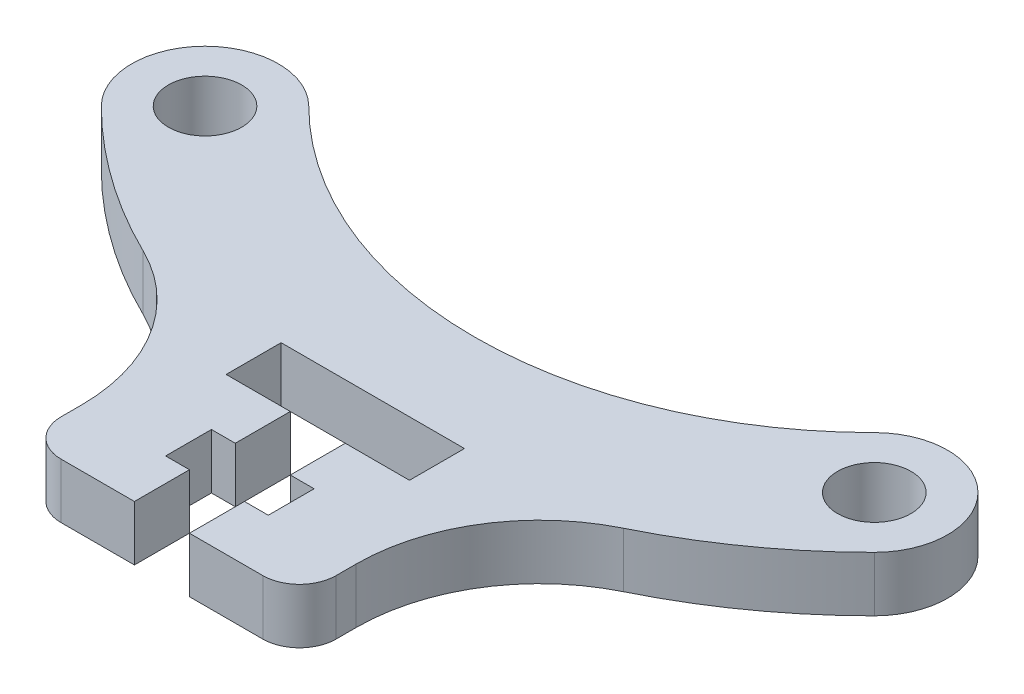
ISO-10303-21;
HEADER;
FILE_DESCRIPTION(('STEP AP214'),'2;1');
FILE_NAME('part.step','',(''),(''),'','','');
FILE_SCHEMA(('AUTOMOTIVE_DESIGN { 1 0 10303 214 1 1 1 1 }'));
ENDSEC;
DATA;
#1=APPLICATION_CONTEXT('core data for automotive mechanical design processes');
#2=APPLICATION_PROTOCOL_DEFINITION('international standard','automotive_design',2000,#1);
#3=PRODUCT_CONTEXT('',#1,'mechanical');
#4=PRODUCT('Part','Part','',(#3));
#5=PRODUCT_RELATED_PRODUCT_CATEGORY('part','',(#4));
#6=PRODUCT_DEFINITION_FORMATION('','',#4);
#7=PRODUCT_DEFINITION_CONTEXT('part definition',#1,'design');
#8=PRODUCT_DEFINITION('design','',#6,#7);
#9=PRODUCT_DEFINITION_SHAPE('','',#8);
#10=(LENGTH_UNIT() NAMED_UNIT(*) SI_UNIT(.MILLI.,.METRE.));
#11=(NAMED_UNIT(*) PLANE_ANGLE_UNIT() SI_UNIT($,.RADIAN.));
#12=(NAMED_UNIT(*) SI_UNIT($,.STERADIAN.) SOLID_ANGLE_UNIT());
#13=UNCERTAINTY_MEASURE_WITH_UNIT(LENGTH_MEASURE(1.E-05),#10,'distance_accuracy_value','');
#14=(GEOMETRIC_REPRESENTATION_CONTEXT(3) GLOBAL_UNCERTAINTY_ASSIGNED_CONTEXT((#13)) GLOBAL_UNIT_ASSIGNED_CONTEXT((#10,
#11,#12)) REPRESENTATION_CONTEXT('',''));
#15=CARTESIAN_POINT('',(0.,0.,0.));
#16=DIRECTION('',(0.,0.,1.));
#17=DIRECTION('',(1.,0.,0.));
#18=AXIS2_PLACEMENT_3D('',#15,#16,#17);
#19=CARTESIAN_POINT('',(-7.5,0.,20.6002501970721));
#20=DIRECTION('',(0.,0.,1.));
#21=DIRECTION('',(1.,0.,0.));
#22=AXIS2_PLACEMENT_3D('',#19,#20,#21);
#23=PLANE('',#22);
#24=DIRECTION('',(1.,0.,0.));
#25=VECTOR('',#24,1.);
#26=CARTESIAN_POINT('',(-7.5,3.,20.6002501970721));
#27=LINE('',#26,#25);
#28=CARTESIAN_POINT('',(-5.5,3.,20.6002501970721));
#29=VERTEX_POINT('',#28);
#30=CARTESIAN_POINT('',(-1.5,3.,20.6002501970721));
#31=VERTEX_POINT('',#30);
#32=EDGE_CURVE('E366',#29,#31,#27,.T.);
#33=ORIENTED_EDGE('',*,*,#32,.F.);
#34=DIRECTION('',(0.,1.,0.));
#35=VECTOR('',#34,1.);
#36=CARTESIAN_POINT('',(-5.5,0.,20.6002501970721));
#37=LINE('',#36,#35);
#38=CARTESIAN_POINT('',(-5.5,0.,20.6002501970721));
#39=VERTEX_POINT('',#38);
#40=EDGE_CURVE('E11',#29,#39,#37,.F.);
#41=ORIENTED_EDGE('',*,*,#40,.T.);
#42=DIRECTION('',(1.,0.,0.));
#43=VECTOR('',#42,1.);
#44=CARTESIAN_POINT('',(-7.5,0.,20.6002501970721));
#45=LINE('',#44,#43);
#46=CARTESIAN_POINT('',(-1.5,0.,20.6002501970721));
#47=VERTEX_POINT('',#46);
#48=EDGE_CURVE('E358',#39,#47,#45,.T.);
#49=ORIENTED_EDGE('',*,*,#48,.T.);
#50=DIRECTION('',(0.,1.,0.));
#51=VECTOR('',#50,1.);
#52=CARTESIAN_POINT('',(-1.5,0.,20.6002501970721));
#53=LINE('',#52,#51);
#54=EDGE_CURVE('E325',#47,#31,#53,.T.);
#55=ORIENTED_EDGE('',*,*,#54,.T.);
#56=EDGE_LOOP('',(#33,#41,#49,#55));
#57=FACE_BOUND('',#56,.T.);
#58=ADVANCED_FACE('F33',(#57),#23,.T.);
#59=CARTESIAN_POINT('',(0.,3.,-18.2508520349051));
#60=DIRECTION('',(0.,-1.,0.));
#61=DIRECTION('',(0.,0.,-1.));
#62=AXIS2_PLACEMENT_3D('',#59,#60,#61);
#63=CYLINDRICAL_SURFACE('',#62,29.81);
#64=CARTESIAN_POINT('',(0.,3.,-18.2508520349051));
#65=DIRECTION('',(0.,1.,0.));
#66=DIRECTION('',(0.,0.,1.));
#67=AXIS2_PLACEMENT_3D('',#64,#65,#66);
#68=CIRCLE('',#67,29.81);
#69=CARTESIAN_POINT('',(13.1041195679478,3.,8.52447523384977));
#70=VERTEX_POINT('',#69);
#71=CARTESIAN_POINT('',(21.0783611003487,3.,2.8284931476025));
#72=VERTEX_POINT('',#71);
#73=EDGE_CURVE('E378',#70,#72,#68,.T.);
#74=ORIENTED_EDGE('',*,*,#73,.F.);
#75=DIRECTION('',(0.,-1.,0.));
#76=VECTOR('',#75,1.);
#77=CARTESIAN_POINT('',(13.1041195679478,3.,8.52447523384977));
#78=LINE('',#77,#76);
#79=CARTESIAN_POINT('',(13.1041195679478,0.,8.52447523384977));
#80=VERTEX_POINT('',#79);
#81=EDGE_CURVE('E417',#70,#80,#78,.T.);
#82=ORIENTED_EDGE('',*,*,#81,.T.);
#83=CARTESIAN_POINT('',(0.,0.,-18.2508520349051));
#84=DIRECTION('',(0.,1.,0.));
#85=DIRECTION('',(0.,0.,1.));
#86=AXIS2_PLACEMENT_3D('',#83,#84,#85);
#87=CIRCLE('',#86,29.81);
#88=CARTESIAN_POINT('',(21.0783611003487,0.,2.8284931476025));
#89=VERTEX_POINT('',#88);
#90=EDGE_CURVE('E396',#80,#89,#87,.T.);
#91=ORIENTED_EDGE('',*,*,#90,.T.);
#92=DIRECTION('',(0.,-1.,0.));
#93=VECTOR('',#92,1.);
#94=CARTESIAN_POINT('',(21.0783611003487,3.,2.8284931476025));
#95=LINE('',#94,#93);
#96=EDGE_CURVE('E388',#72,#89,#95,.T.);
#97=ORIENTED_EDGE('',*,*,#96,.F.);
#98=EDGE_LOOP('',(#74,#82,#91,#97));
#99=FACE_BOUND('',#98,.T.);
#100=ADVANCED_FACE('F552',(#99),#63,.T.);
#101=CARTESIAN_POINT('',(18.25,3.,0.));
#102=DIRECTION('',(0.,-1.,0.));
#103=DIRECTION('',(0.,0.,-1.));
#104=AXIS2_PLACEMENT_3D('',#101,#102,#103);
#105=CYLINDRICAL_SURFACE('',#104,4.);
#106=CARTESIAN_POINT('',(18.25,0.,0.));
#107=DIRECTION('',(0.,1.,0.));
#108=DIRECTION('',(0.,0.,1.));
#109=AXIS2_PLACEMENT_3D('',#106,#107,#108);
#110=CIRCLE('',#109,4.);
#111=CARTESIAN_POINT('',(15.4216388996513,0.,-2.82849314760251));
#112=VERTEX_POINT('',#111);
#113=EDGE_CURVE('E362',#112,#89,#110,.F.);
#114=ORIENTED_EDGE('',*,*,#113,.F.);
#115=DIRECTION('',(0.,-1.,0.));
#116=VECTOR('',#115,1.);
#117=CARTESIAN_POINT('',(15.4216388996513,3.,-2.82849314760251));
#118=LINE('',#117,#116);
#119=CARTESIAN_POINT('',(15.4216388996513,3.,-2.82849314760251));
#120=VERTEX_POINT('',#119);
#121=EDGE_CURVE('E412',#120,#112,#118,.T.);
#122=ORIENTED_EDGE('',*,*,#121,.F.);
#123=CARTESIAN_POINT('',(18.25,3.,0.));
#124=DIRECTION('',(0.,1.,0.));
#125=DIRECTION('',(0.,0.,1.));
#126=AXIS2_PLACEMENT_3D('',#123,#124,#125);
#127=CIRCLE('',#126,4.);
#128=EDGE_CURVE('E369',#120,#72,#127,.F.);
#129=ORIENTED_EDGE('',*,*,#128,.T.);
#130=ORIENTED_EDGE('',*,*,#96,.T.);
#131=EDGE_LOOP('',(#114,#122,#129,#130));
#132=FACE_BOUND('',#131,.T.);
#133=ADVANCED_FACE('F474',(#132),#105,.T.);
#134=CARTESIAN_POINT('',(0.,3.,-18.2508520349051));
#135=DIRECTION('',(0.,-1.,0.));
#136=DIRECTION('',(0.,0.,-1.));
#137=AXIS2_PLACEMENT_3D('',#134,#135,#136);
#138=CYLINDRICAL_SURFACE('',#137,21.81);
#139=CARTESIAN_POINT('',(0.,0.,-18.2508520349051));
#140=DIRECTION('',(0.,1.,0.));
#141=DIRECTION('',(0.,0.,1.));
#142=AXIS2_PLACEMENT_3D('',#139,#140,#141);
#143=CIRCLE('',#142,21.81);
#144=CARTESIAN_POINT('',(-15.4216388996513,0.,-2.8284931476025));
#145=VERTEX_POINT('',#144);
#146=EDGE_CURVE('E391',#145,#112,#143,.T.);
#147=ORIENTED_EDGE('',*,*,#146,.F.);
#148=DIRECTION('',(0.,-1.,0.));
#149=VECTOR('',#148,1.);
#150=CARTESIAN_POINT('',(-15.4216388996513,3.,-2.8284931476025));
#151=LINE('',#150,#149);
#152=CARTESIAN_POINT('',(-15.4216388996513,3.,-2.8284931476025));
#153=VERTEX_POINT('',#152);
#154=EDGE_CURVE('E410',#153,#145,#151,.T.);
#155=ORIENTED_EDGE('',*,*,#154,.F.);
#156=CARTESIAN_POINT('',(0.,3.,-18.2508520349051));
#157=DIRECTION('',(0.,1.,0.));
#158=DIRECTION('',(0.,0.,1.));
#159=AXIS2_PLACEMENT_3D('',#156,#157,#158);
#160=CIRCLE('',#159,21.81);
#161=EDGE_CURVE('E372',#153,#120,#160,.T.);
#162=ORIENTED_EDGE('',*,*,#161,.T.);
#163=ORIENTED_EDGE('',*,*,#121,.T.);
#164=EDGE_LOOP('',(#147,#155,#162,#163));
#165=FACE_BOUND('',#164,.T.);
#166=ADVANCED_FACE('F468',(#165),#138,.F.);
#167=CARTESIAN_POINT('',(-18.25,3.,0.));
#168=DIRECTION('',(0.,-1.,0.));
#169=DIRECTION('',(0.,0.,-1.));
#170=AXIS2_PLACEMENT_3D('',#167,#168,#169);
#171=CYLINDRICAL_SURFACE('',#170,4.);
#172=CARTESIAN_POINT('',(-18.25,0.,0.));
#173=DIRECTION('',(0.,1.,0.));
#174=DIRECTION('',(0.,0.,1.));
#175=AXIS2_PLACEMENT_3D('',#172,#173,#174);
#176=CIRCLE('',#175,4.);
#177=CARTESIAN_POINT('',(-21.0783611003487,0.,2.82849314760249));
#178=VERTEX_POINT('',#177);
#179=EDGE_CURVE('E394',#145,#178,#176,.T.);
#180=ORIENTED_EDGE('',*,*,#179,.T.);
#181=DIRECTION('',(0.,-1.,0.));
#182=VECTOR('',#181,1.);
#183=CARTESIAN_POINT('',(-21.0783611003487,3.,2.82849314760249));
#184=LINE('',#183,#182);
#185=CARTESIAN_POINT('',(-21.0783611003487,3.,2.82849314760249));
#186=VERTEX_POINT('',#185);
#187=EDGE_CURVE('E407',#186,#178,#184,.T.);
#188=ORIENTED_EDGE('',*,*,#187,.F.);
#189=CARTESIAN_POINT('',(-18.25,3.,0.));
#190=DIRECTION('',(0.,1.,0.));
#191=DIRECTION('',(0.,0.,1.));
#192=AXIS2_PLACEMENT_3D('',#189,#190,#191);
#193=CIRCLE('',#192,4.);
#194=EDGE_CURVE('E376',#153,#186,#193,.T.);
#195=ORIENTED_EDGE('',*,*,#194,.F.);
#196=ORIENTED_EDGE('',*,*,#154,.T.);
#197=EDGE_LOOP('',(#180,#188,#195,#196));
#198=FACE_BOUND('',#197,.T.);
#199=ADVANCED_FACE('F782',(#198),#171,.T.);
#200=CARTESIAN_POINT('',(18.25,3.,0.));
#201=DIRECTION('',(0.,-1.,0.));
#202=DIRECTION('',(0.,0.,-1.));
#203=AXIS2_PLACEMENT_3D('',#200,#201,#202);
#204=CYLINDRICAL_SURFACE('',#203,2.);
#205=CARTESIAN_POINT('',(18.25,3.,0.));
#206=DIRECTION('',(0.,1.,0.));
#207=DIRECTION('',(0.,0.,1.));
#208=AXIS2_PLACEMENT_3D('',#205,#206,#207);
#209=CIRCLE('',#208,2.);
#210=CARTESIAN_POINT('',(18.25,3.,1.99999999999999));
#211=VERTEX_POINT('',#210);
#212=EDGE_CURVE('E382',#211,#211,#209,.T.);
#213=ORIENTED_EDGE('',*,*,#212,.T.);
#214=EDGE_LOOP('',(#213));
#215=FACE_BOUND('',#214,.T.);
#216=CARTESIAN_POINT('',(18.25,0.,0.));
#217=DIRECTION('',(0.,1.,0.));
#218=DIRECTION('',(0.,0.,1.));
#219=AXIS2_PLACEMENT_3D('',#216,#217,#218);
#220=CIRCLE('',#219,2.);
#221=CARTESIAN_POINT('',(18.25,0.,1.99999999999999));
#222=VERTEX_POINT('',#221);
#223=EDGE_CURVE('E400',#222,#222,#220,.T.);
#224=ORIENTED_EDGE('',*,*,#223,.F.);
#225=EDGE_LOOP('',(#224));
#226=FACE_BOUND('',#225,.T.);
#227=ADVANCED_FACE('F764',(#215,#226),#204,.F.);
#228=CARTESIAN_POINT('',(-13.1041195679478,0.,8.52447523384977));
#229=VERTEX_POINT('',#228);
#230=EDGE_CURVE('E397',#178,#229,#87,.T.);
#231=ORIENTED_EDGE('',*,*,#230,.T.);
#232=DIRECTION('',(0.,-1.,0.));
#233=VECTOR('',#232,1.);
#234=CARTESIAN_POINT('',(-13.1041195679478,3.,8.52447523384977));
#235=LINE('',#234,#233);
#236=CARTESIAN_POINT('',(-13.1041195679478,3.,8.52447523384977));
#237=VERTEX_POINT('',#236);
#238=EDGE_CURVE('E419',#229,#237,#235,.F.);
#239=ORIENTED_EDGE('',*,*,#238,.T.);
#240=EDGE_CURVE('E379',#186,#237,#68,.T.);
#241=ORIENTED_EDGE('',*,*,#240,.F.);
#242=ORIENTED_EDGE('',*,*,#187,.T.);
#243=EDGE_LOOP('',(#231,#239,#241,#242));
#244=FACE_BOUND('',#243,.T.);
#245=ADVANCED_FACE('F461',(#244),#63,.T.);
#246=CARTESIAN_POINT('',(-18.25,3.,0.));
#247=DIRECTION('',(0.,-1.,0.));
#248=DIRECTION('',(0.,0.,-1.));
#249=AXIS2_PLACEMENT_3D('',#246,#247,#248);
#250=CYLINDRICAL_SURFACE('',#249,2.);
#251=CARTESIAN_POINT('',(-18.25,3.,0.));
#252=DIRECTION('',(0.,1.,0.));
#253=DIRECTION('',(0.,0.,1.));
#254=AXIS2_PLACEMENT_3D('',#251,#252,#253);
#255=CIRCLE('',#254,2.);
#256=CARTESIAN_POINT('',(-18.25,3.,2.));
#257=VERTEX_POINT('',#256);
#258=EDGE_CURVE('E385',#257,#257,#255,.T.);
#259=ORIENTED_EDGE('',*,*,#258,.T.);
#260=EDGE_LOOP('',(#259));
#261=FACE_BOUND('',#260,.T.);
#262=CARTESIAN_POINT('',(-18.25,0.,0.));
#263=DIRECTION('',(0.,1.,0.));
#264=DIRECTION('',(0.,0.,1.));
#265=AXIS2_PLACEMENT_3D('',#262,#263,#264);
#266=CIRCLE('',#265,2.);
#267=CARTESIAN_POINT('',(-18.25,0.,2.));
#268=VERTEX_POINT('',#267);
#269=EDGE_CURVE('E373',#268,#268,#266,.T.);
#270=ORIENTED_EDGE('',*,*,#269,.F.);
#271=EDGE_LOOP('',(#270));
#272=FACE_BOUND('',#271,.T.);
#273=ADVANCED_FACE('F751',(#261,#272),#250,.F.);
#274=CARTESIAN_POINT('',(0.,3.,0.));
#275=DIRECTION('',(0.,1.,0.));
#276=DIRECTION('',(0.,0.,1.));
#277=AXIS2_PLACEMENT_3D('',#274,#275,#276);
#278=PLANE('',#277);
#279=CARTESIAN_POINT('',(1.5,3.,20.6002501970721));
#280=VERTEX_POINT('',#279);
#281=CARTESIAN_POINT('',(5.5,3.,20.6002501970721));
#282=VERTEX_POINT('',#281);
#283=EDGE_CURVE('E365',#280,#282,#27,.T.);
#284=ORIENTED_EDGE('',*,*,#283,.T.);
#285=CARTESIAN_POINT('',(5.5,3.,18.6002501970721));
#286=DIRECTION('',(0.,1.,0.));
#287=DIRECTION('',(0.,0.,1.));
#288=AXIS2_PLACEMENT_3D('',#285,#286,#287);
#289=CIRCLE('',#288,2.);
#290=CARTESIAN_POINT('',(7.5,3.,18.6002501970721));
#291=VERTEX_POINT('',#290);
#292=EDGE_CURVE('E438',#282,#291,#289,.T.);
#293=ORIENTED_EDGE('',*,*,#292,.T.);
#294=DIRECTION('',(0.,0.,-1.));
#295=VECTOR('',#294,1.);
#296=CARTESIAN_POINT('',(7.5,3.,20.6002501970721));
#297=LINE('',#296,#295);
#298=CARTESIAN_POINT('',(7.5,3.,17.5064702921372));
#299=VERTEX_POINT('',#298);
#300=EDGE_CURVE('E357',#291,#299,#297,.T.);
#301=ORIENTED_EDGE('',*,*,#300,.T.);
#302=CARTESIAN_POINT('',(17.5,3.,17.5064702921372));
#303=DIRECTION('',(0.,1.,0.));
#304=DIRECTION('',(0.,0.,1.));
#305=AXIS2_PLACEMENT_3D('',#302,#303,#304);
#306=CIRCLE('',#305,10.);
#307=EDGE_CURVE('E424',#299,#70,#306,.F.);
#308=ORIENTED_EDGE('',*,*,#307,.T.);
#309=ORIENTED_EDGE('',*,*,#73,.T.);
#310=ORIENTED_EDGE('',*,*,#128,.F.);
#311=ORIENTED_EDGE('',*,*,#161,.F.);
#312=ORIENTED_EDGE('',*,*,#194,.T.);
#313=ORIENTED_EDGE('',*,*,#240,.T.);
#314=CARTESIAN_POINT('',(-17.5,3.,17.5064702921372));
#315=DIRECTION('',(0.,1.,0.));
#316=DIRECTION('',(0.,0.,1.));
#317=AXIS2_PLACEMENT_3D('',#314,#315,#316);
#318=CIRCLE('',#317,10.);
#319=CARTESIAN_POINT('',(-7.5,3.,17.5064702921372));
#320=VERTEX_POINT('',#319);
#321=EDGE_CURVE('E429',#237,#320,#318,.F.);
#322=ORIENTED_EDGE('',*,*,#321,.T.);
#323=DIRECTION('',(0.,0.,1.));
#324=VECTOR('',#323,1.);
#325=CARTESIAN_POINT('',(-7.5,3.,10.6002501970721));
#326=LINE('',#325,#324);
#327=CARTESIAN_POINT('',(-7.5,3.,18.6002501970721));
#328=VERTEX_POINT('',#327);
#329=EDGE_CURVE('E328',#320,#328,#326,.T.);
#330=ORIENTED_EDGE('',*,*,#329,.T.);
#331=CARTESIAN_POINT('',(-5.5,3.,18.6002501970721));
#332=DIRECTION('',(0.,1.,0.));
#333=DIRECTION('',(0.,0.,1.));
#334=AXIS2_PLACEMENT_3D('',#331,#332,#333);
#335=CIRCLE('',#334,2.);
#336=EDGE_CURVE('E436',#328,#29,#335,.T.);
#337=ORIENTED_EDGE('',*,*,#336,.T.);
#338=ORIENTED_EDGE('',*,*,#32,.T.);
#339=DIRECTION('',(0.,0.,1.));
#340=VECTOR('',#339,1.);
#341=CARTESIAN_POINT('',(-1.5,3.,20.6002501970721));
#342=LINE('',#341,#340);
#343=CARTESIAN_POINT('',(-1.5,3.,17.6002501970721));
#344=VERTEX_POINT('',#343);
#345=EDGE_CURVE('E244',#344,#31,#342,.T.);
#346=ORIENTED_EDGE('',*,*,#345,.F.);
#347=DIRECTION('',(1.,0.,0.));
#348=VECTOR('',#347,1.);
#349=CARTESIAN_POINT('',(-1.5,3.,17.6002501970721));
#350=LINE('',#349,#348);
#351=CARTESIAN_POINT('',(-2.8,3.,17.6002501970721));
#352=VERTEX_POINT('',#351);
#353=EDGE_CURVE('E247',#352,#344,#350,.T.);
#354=ORIENTED_EDGE('',*,*,#353,.F.);
#355=DIRECTION('',(0.,0.,1.));
#356=VECTOR('',#355,1.);
#357=CARTESIAN_POINT('',(-2.8,3.,17.6002501970721));
#358=LINE('',#357,#356);
#359=CARTESIAN_POINT('',(-2.8,3.,15.1002501970721));
#360=VERTEX_POINT('',#359);
#361=EDGE_CURVE('E320',#360,#352,#358,.T.);
#362=ORIENTED_EDGE('',*,*,#361,.F.);
#363=DIRECTION('',(-1.,0.,0.));
#364=VECTOR('',#363,1.);
#365=CARTESIAN_POINT('',(-2.8,3.,15.1002501970721));
#366=LINE('',#365,#364);
#367=CARTESIAN_POINT('',(-1.5,3.,15.1002501970721));
#368=VERTEX_POINT('',#367);
#369=EDGE_CURVE('E317',#368,#360,#366,.T.);
#370=ORIENTED_EDGE('',*,*,#369,.F.);
#371=DIRECTION('',(0.,0.,1.));
#372=VECTOR('',#371,1.);
#373=CARTESIAN_POINT('',(-1.5,3.,15.1002501970721));
#374=LINE('',#373,#372);
#375=CARTESIAN_POINT('',(-1.5,3.,12.1002501970721));
#376=VERTEX_POINT('',#375);
#377=EDGE_CURVE('E314',#376,#368,#374,.T.);
#378=ORIENTED_EDGE('',*,*,#377,.F.);
#379=DIRECTION('',(1.,0.,0.));
#380=VECTOR('',#379,1.);
#381=CARTESIAN_POINT('',(-1.5,3.,12.1002501970721));
#382=LINE('',#381,#380);
#383=CARTESIAN_POINT('',(-5.,3.,12.1002501970721));
#384=VERTEX_POINT('',#383);
#385=EDGE_CURVE('E311',#384,#376,#382,.T.);
#386=ORIENTED_EDGE('',*,*,#385,.F.);
#387=DIRECTION('',(0.,0.,1.));
#388=VECTOR('',#387,1.);
#389=CARTESIAN_POINT('',(-5.,3.,12.1002501970721));
#390=LINE('',#389,#388);
#391=CARTESIAN_POINT('',(-5.,3.,9.10025019707209));
#392=VERTEX_POINT('',#391);
#393=EDGE_CURVE('E308',#392,#384,#390,.T.);
#394=ORIENTED_EDGE('',*,*,#393,.F.);
#395=DIRECTION('',(-1.,0.,0.));
#396=VECTOR('',#395,1.);
#397=CARTESIAN_POINT('',(-5.,3.,9.10025019707209));
#398=LINE('',#397,#396);
#399=CARTESIAN_POINT('',(5.,3.,9.10025019707209));
#400=VERTEX_POINT('',#399);
#401=EDGE_CURVE('E305',#400,#392,#398,.T.);
#402=ORIENTED_EDGE('',*,*,#401,.F.);
#403=DIRECTION('',(0.,0.,-1.));
#404=VECTOR('',#403,1.);
#405=CARTESIAN_POINT('',(5.,3.,9.10025019707209));
#406=LINE('',#405,#404);
#407=CARTESIAN_POINT('',(5.,3.,12.1002501970721));
#408=VERTEX_POINT('',#407);
#409=EDGE_CURVE('E302',#408,#400,#406,.T.);
#410=ORIENTED_EDGE('',*,*,#409,.F.);
#411=DIRECTION('',(1.,0.,0.));
#412=VECTOR('',#411,1.);
#413=CARTESIAN_POINT('',(5.,3.,12.1002501970721));
#414=LINE('',#413,#412);
#415=CARTESIAN_POINT('',(1.5,3.,12.1002501970721));
#416=VERTEX_POINT('',#415);
#417=EDGE_CURVE('E299',#416,#408,#414,.T.);
#418=ORIENTED_EDGE('',*,*,#417,.F.);
#419=DIRECTION('',(0.,0.,-1.));
#420=VECTOR('',#419,1.);
#421=CARTESIAN_POINT('',(1.5,3.,12.1002501970721));
#422=LINE('',#421,#420);
#423=CARTESIAN_POINT('',(1.5,3.,15.1002501970721));
#424=VERTEX_POINT('',#423);
#425=EDGE_CURVE('E296',#424,#416,#422,.T.);
#426=ORIENTED_EDGE('',*,*,#425,.F.);
#427=DIRECTION('',(-1.,0.,0.));
#428=VECTOR('',#427,1.);
#429=CARTESIAN_POINT('',(1.5,3.,15.1002501970721));
#430=LINE('',#429,#428);
#431=CARTESIAN_POINT('',(2.8,3.,15.1002501970721));
#432=VERTEX_POINT('',#431);
#433=EDGE_CURVE('E293',#432,#424,#430,.T.);
#434=ORIENTED_EDGE('',*,*,#433,.F.);
#435=DIRECTION('',(0.,0.,-1.));
#436=VECTOR('',#435,1.);
#437=CARTESIAN_POINT('',(2.8,3.,15.1002501970721));
#438=LINE('',#437,#436);
#439=CARTESIAN_POINT('',(2.8,3.,17.6002501970721));
#440=VERTEX_POINT('',#439);
#441=EDGE_CURVE('E290',#440,#432,#438,.T.);
#442=ORIENTED_EDGE('',*,*,#441,.F.);
#443=DIRECTION('',(1.,0.,0.));
#444=VECTOR('',#443,1.);
#445=CARTESIAN_POINT('',(2.8,3.,17.6002501970721));
#446=LINE('',#445,#444);
#447=CARTESIAN_POINT('',(1.5,3.,17.6002501970721));
#448=VERTEX_POINT('',#447);
#449=EDGE_CURVE('E288',#448,#440,#446,.T.);
#450=ORIENTED_EDGE('',*,*,#449,.F.);
#451=DIRECTION('',(0.,0.,-1.));
#452=VECTOR('',#451,1.);
#453=CARTESIAN_POINT('',(1.5,3.,17.6002501970721));
#454=LINE('',#453,#452);
#455=EDGE_CURVE('E224',#280,#448,#454,.T.);
#456=ORIENTED_EDGE('',*,*,#455,.F.);
#457=EDGE_LOOP('',(#284,#293,#301,#308,#309,#310,#311,#312,#313,#322,#330,#337,#338,#346,#354,
#362,#370,#378,#386,#394,#402,#410,#418,#426,#434,#442,#450,#456));
#458=FACE_BOUND('',#457,.T.);
#459=ORIENTED_EDGE('',*,*,#212,.F.);
#460=EDGE_LOOP('',(#459));
#461=FACE_BOUND('',#460,.T.);
#462=ORIENTED_EDGE('',*,*,#258,.F.);
#463=EDGE_LOOP('',(#462));
#464=FACE_BOUND('',#463,.T.);
#465=ADVANCED_FACE('F453',(#458,#461,#464),#278,.T.);
#466=CARTESIAN_POINT('',(0.,0.,0.));
#467=DIRECTION('',(0.,1.,0.));
#468=DIRECTION('',(0.,0.,1.));
#469=AXIS2_PLACEMENT_3D('',#466,#467,#468);
#470=PLANE('',#469);
#471=DIRECTION('',(0.,0.,-1.));
#472=VECTOR('',#471,1.);
#473=CARTESIAN_POINT('',(7.5,0.,20.6002501970721));
#474=LINE('',#473,#472);
#475=CARTESIAN_POINT('',(7.5,0.,18.6002501970721));
#476=VERTEX_POINT('',#475);
#477=CARTESIAN_POINT('',(7.5,0.,17.5064702921372));
#478=VERTEX_POINT('',#477);
#479=EDGE_CURVE('E360',#476,#478,#474,.T.);
#480=ORIENTED_EDGE('',*,*,#479,.F.);
#481=CARTESIAN_POINT('',(5.5,0.,18.6002501970721));
#482=DIRECTION('',(0.,1.,0.));
#483=DIRECTION('',(0.,0.,1.));
#484=AXIS2_PLACEMENT_3D('',#481,#482,#483);
#485=CIRCLE('',#484,2.);
#486=CARTESIAN_POINT('',(5.5,0.,20.6002501970721));
#487=VERTEX_POINT('',#486);
#488=EDGE_CURVE('E443',#476,#487,#485,.F.);
#489=ORIENTED_EDGE('',*,*,#488,.T.);
#490=CARTESIAN_POINT('',(1.5,0.,20.6002501970721));
#491=VERTEX_POINT('',#490);
#492=EDGE_CURVE('E243',#491,#487,#45,.T.);
#493=ORIENTED_EDGE('',*,*,#492,.F.);
#494=DIRECTION('',(0.,0.,-1.));
#495=VECTOR('',#494,1.);
#496=CARTESIAN_POINT('',(1.5,0.,17.6002501970721));
#497=LINE('',#496,#495);
#498=CARTESIAN_POINT('',(1.5,0.,17.6002501970721));
#499=VERTEX_POINT('',#498);
#500=EDGE_CURVE('E221',#491,#499,#497,.T.);
#501=ORIENTED_EDGE('',*,*,#500,.T.);
#502=DIRECTION('',(1.,0.,0.));
#503=VECTOR('',#502,1.);
#504=CARTESIAN_POINT('',(2.8,0.,17.6002501970721));
#505=LINE('',#504,#503);
#506=CARTESIAN_POINT('',(2.8,0.,17.6002501970721));
#507=VERTEX_POINT('',#506);
#508=EDGE_CURVE('E232',#499,#507,#505,.T.);
#509=ORIENTED_EDGE('',*,*,#508,.T.);
#510=DIRECTION('',(0.,0.,-1.));
#511=VECTOR('',#510,1.);
#512=CARTESIAN_POINT('',(2.8,0.,15.1002501970721));
#513=LINE('',#512,#511);
#514=CARTESIAN_POINT('',(2.8,0.,15.1002501970721));
#515=VERTEX_POINT('',#514);
#516=EDGE_CURVE('E236',#507,#515,#513,.T.);
#517=ORIENTED_EDGE('',*,*,#516,.T.);
#518=DIRECTION('',(-1.,0.,0.));
#519=VECTOR('',#518,1.);
#520=CARTESIAN_POINT('',(1.5,0.,15.1002501970721));
#521=LINE('',#520,#519);
#522=CARTESIAN_POINT('',(1.5,0.,15.1002501970721));
#523=VERTEX_POINT('',#522);
#524=EDGE_CURVE('E251',#515,#523,#521,.T.);
#525=ORIENTED_EDGE('',*,*,#524,.T.);
#526=DIRECTION('',(0.,0.,-1.));
#527=VECTOR('',#526,1.);
#528=CARTESIAN_POINT('',(1.5,0.,12.1002501970721));
#529=LINE('',#528,#527);
#530=CARTESIAN_POINT('',(1.5,0.,12.1002501970721));
#531=VERTEX_POINT('',#530);
#532=EDGE_CURVE('E254',#523,#531,#529,.T.);
#533=ORIENTED_EDGE('',*,*,#532,.T.);
#534=DIRECTION('',(1.,0.,0.));
#535=VECTOR('',#534,1.);
#536=CARTESIAN_POINT('',(5.,0.,12.1002501970721));
#537=LINE('',#536,#535);
#538=CARTESIAN_POINT('',(5.,0.,12.1002501970721));
#539=VERTEX_POINT('',#538);
#540=EDGE_CURVE('E257',#531,#539,#537,.T.);
#541=ORIENTED_EDGE('',*,*,#540,.T.);
#542=DIRECTION('',(0.,0.,-1.));
#543=VECTOR('',#542,1.);
#544=CARTESIAN_POINT('',(5.,0.,9.10025019707209));
#545=LINE('',#544,#543);
#546=CARTESIAN_POINT('',(5.,0.,9.10025019707209));
#547=VERTEX_POINT('',#546);
#548=EDGE_CURVE('E260',#539,#547,#545,.T.);
#549=ORIENTED_EDGE('',*,*,#548,.T.);
#550=DIRECTION('',(-1.,0.,0.));
#551=VECTOR('',#550,1.);
#552=CARTESIAN_POINT('',(-5.,0.,9.10025019707209));
#553=LINE('',#552,#551);
#554=CARTESIAN_POINT('',(-5.,0.,9.10025019707209));
#555=VERTEX_POINT('',#554);
#556=EDGE_CURVE('E263',#547,#555,#553,.T.);
#557=ORIENTED_EDGE('',*,*,#556,.T.);
#558=DIRECTION('',(0.,0.,1.));
#559=VECTOR('',#558,1.);
#560=CARTESIAN_POINT('',(-5.,0.,12.1002501970721));
#561=LINE('',#560,#559);
#562=CARTESIAN_POINT('',(-5.,0.,12.1002501970721));
#563=VERTEX_POINT('',#562);
#564=EDGE_CURVE('E266',#555,#563,#561,.T.);
#565=ORIENTED_EDGE('',*,*,#564,.T.);
#566=DIRECTION('',(1.,0.,0.));
#567=VECTOR('',#566,1.);
#568=CARTESIAN_POINT('',(-1.5,0.,12.1002501970721));
#569=LINE('',#568,#567);
#570=CARTESIAN_POINT('',(-1.5,0.,12.1002501970721));
#571=VERTEX_POINT('',#570);
#572=EDGE_CURVE('E269',#563,#571,#569,.T.);
#573=ORIENTED_EDGE('',*,*,#572,.T.);
#574=DIRECTION('',(0.,0.,1.));
#575=VECTOR('',#574,1.);
#576=CARTESIAN_POINT('',(-1.5,0.,15.1002501970721));
#577=LINE('',#576,#575);
#578=CARTESIAN_POINT('',(-1.5,0.,15.1002501970721));
#579=VERTEX_POINT('',#578);
#580=EDGE_CURVE('E272',#571,#579,#577,.T.);
#581=ORIENTED_EDGE('',*,*,#580,.T.);
#582=DIRECTION('',(-1.,0.,0.));
#583=VECTOR('',#582,1.);
#584=CARTESIAN_POINT('',(-2.8,0.,15.1002501970721));
#585=LINE('',#584,#583);
#586=CARTESIAN_POINT('',(-2.8,0.,15.1002501970721));
#587=VERTEX_POINT('',#586);
#588=EDGE_CURVE('E275',#579,#587,#585,.T.);
#589=ORIENTED_EDGE('',*,*,#588,.T.);
#590=DIRECTION('',(0.,0.,1.));
#591=VECTOR('',#590,1.);
#592=CARTESIAN_POINT('',(-2.8,0.,17.6002501970721));
#593=LINE('',#592,#591);
#594=CARTESIAN_POINT('',(-2.8,0.,17.6002501970721));
#595=VERTEX_POINT('',#594);
#596=EDGE_CURVE('E278',#587,#595,#593,.T.);
#597=ORIENTED_EDGE('',*,*,#596,.T.);
#598=DIRECTION('',(1.,0.,0.));
#599=VECTOR('',#598,1.);
#600=CARTESIAN_POINT('',(-1.5,0.,17.6002501970721));
#601=LINE('',#600,#599);
#602=CARTESIAN_POINT('',(-1.5,0.,17.6002501970721));
#603=VERTEX_POINT('',#602);
#604=EDGE_CURVE('E281',#595,#603,#601,.T.);
#605=ORIENTED_EDGE('',*,*,#604,.T.);
#606=DIRECTION('',(0.,0.,1.));
#607=VECTOR('',#606,1.);
#608=CARTESIAN_POINT('',(-1.5,0.,20.6002501970721));
#609=LINE('',#608,#607);
#610=EDGE_CURVE('E284',#603,#47,#609,.T.);
#611=ORIENTED_EDGE('',*,*,#610,.T.);
#612=ORIENTED_EDGE('',*,*,#48,.F.);
#613=CARTESIAN_POINT('',(-5.5,0.,18.6002501970721));
#614=DIRECTION('',(0.,1.,0.));
#615=DIRECTION('',(0.,0.,1.));
#616=AXIS2_PLACEMENT_3D('',#613,#614,#615);
#617=CIRCLE('',#616,2.);
#618=CARTESIAN_POINT('',(-7.5,0.,18.6002501970721));
#619=VERTEX_POINT('',#618);
#620=EDGE_CURVE('E48',#39,#619,#617,.F.);
#621=ORIENTED_EDGE('',*,*,#620,.T.);
#622=DIRECTION('',(0.,0.,1.));
#623=VECTOR('',#622,1.);
#624=CARTESIAN_POINT('',(-7.5,0.,10.6002501970721));
#625=LINE('',#624,#623);
#626=CARTESIAN_POINT('',(-7.5,0.,17.5064702921372));
#627=VERTEX_POINT('',#626);
#628=EDGE_CURVE('E355',#627,#619,#625,.T.);
#629=ORIENTED_EDGE('',*,*,#628,.F.);
#630=CARTESIAN_POINT('',(-17.5,0.,17.5064702921372));
#631=DIRECTION('',(0.,1.,0.));
#632=DIRECTION('',(0.,0.,1.));
#633=AXIS2_PLACEMENT_3D('',#630,#631,#632);
#634=CIRCLE('',#633,10.);
#635=EDGE_CURVE('E431',#627,#229,#634,.T.);
#636=ORIENTED_EDGE('',*,*,#635,.T.);
#637=ORIENTED_EDGE('',*,*,#230,.F.);
#638=ORIENTED_EDGE('',*,*,#179,.F.);
#639=ORIENTED_EDGE('',*,*,#146,.T.);
#640=ORIENTED_EDGE('',*,*,#113,.T.);
#641=ORIENTED_EDGE('',*,*,#90,.F.);
#642=CARTESIAN_POINT('',(17.5,0.,17.5064702921372));
#643=DIRECTION('',(0.,1.,0.));
#644=DIRECTION('',(0.,0.,1.));
#645=AXIS2_PLACEMENT_3D('',#642,#643,#644);
#646=CIRCLE('',#645,10.);
#647=EDGE_CURVE('E426',#80,#478,#646,.T.);
#648=ORIENTED_EDGE('',*,*,#647,.T.);
#649=EDGE_LOOP('',(#480,#489,#493,#501,#509,#517,#525,#533,#541,#549,#557,#565,#573,#581,#589,
#597,#605,#611,#612,#621,#629,#636,#637,#638,#639,#640,#641,#648));
#650=FACE_BOUND('',#649,.T.);
#651=ORIENTED_EDGE('',*,*,#223,.T.);
#652=EDGE_LOOP('',(#651));
#653=FACE_BOUND('',#652,.T.);
#654=ORIENTED_EDGE('',*,*,#269,.T.);
#655=EDGE_LOOP('',(#654));
#656=FACE_BOUND('',#655,.T.);
#657=ADVANCED_FACE('F240',(#650,#653,#656),#470,.F.);
#658=CARTESIAN_POINT('',(7.5,0.,20.6002501970721));
#659=DIRECTION('',(1.,0.,0.));
#660=DIRECTION('',(0.,0.,-1.));
#661=AXIS2_PLACEMENT_3D('',#658,#659,#660);
#662=PLANE('',#661);
#663=ORIENTED_EDGE('',*,*,#300,.F.);
#664=DIRECTION('',(0.,1.,0.));
#665=VECTOR('',#664,1.);
#666=CARTESIAN_POINT('',(7.5,0.,18.6002501970721));
#667=LINE('',#666,#665);
#668=EDGE_CURVE('E440',#291,#476,#667,.F.);
#669=ORIENTED_EDGE('',*,*,#668,.T.);
#670=ORIENTED_EDGE('',*,*,#479,.T.);
#671=DIRECTION('',(0.,-1.,0.));
#672=VECTOR('',#671,1.);
#673=CARTESIAN_POINT('',(7.5,0.,17.5064702921372));
#674=LINE('',#673,#672);
#675=EDGE_CURVE('E414',#478,#299,#674,.F.);
#676=ORIENTED_EDGE('',*,*,#675,.T.);
#677=EDGE_LOOP('',(#663,#669,#670,#676));
#678=FACE_BOUND('',#677,.T.);
#679=ADVANCED_FACE('F486',(#678),#662,.T.);
#680=ORIENTED_EDGE('',*,*,#492,.T.);
#681=DIRECTION('',(0.,1.,0.));
#682=VECTOR('',#681,1.);
#683=CARTESIAN_POINT('',(5.5,0.,20.6002501970721));
#684=LINE('',#683,#682);
#685=EDGE_CURVE('E433',#487,#282,#684,.T.);
#686=ORIENTED_EDGE('',*,*,#685,.T.);
#687=ORIENTED_EDGE('',*,*,#283,.F.);
#688=DIRECTION('',(0.,1.,0.));
#689=VECTOR('',#688,1.);
#690=CARTESIAN_POINT('',(1.5,0.,20.6002501970721));
#691=LINE('',#690,#689);
#692=EDGE_CURVE('E229',#491,#280,#691,.T.);
#693=ORIENTED_EDGE('',*,*,#692,.F.);
#694=EDGE_LOOP('',(#680,#686,#687,#693));
#695=FACE_BOUND('',#694,.T.);
#696=ADVANCED_FACE('F494',(#695),#23,.T.);
#697=CARTESIAN_POINT('',(-7.5,0.,10.6002501970721));
#698=DIRECTION('',(-1.,0.,0.));
#699=DIRECTION('',(0.,0.,1.));
#700=AXIS2_PLACEMENT_3D('',#697,#698,#699);
#701=PLANE('',#700);
#702=ORIENTED_EDGE('',*,*,#628,.T.);
#703=DIRECTION('',(0.,1.,0.));
#704=VECTOR('',#703,1.);
#705=CARTESIAN_POINT('',(-7.5,0.,18.6002501970721));
#706=LINE('',#705,#704);
#707=EDGE_CURVE('E41',#619,#328,#706,.T.);
#708=ORIENTED_EDGE('',*,*,#707,.T.);
#709=ORIENTED_EDGE('',*,*,#329,.F.);
#710=DIRECTION('',(0.,-1.,0.));
#711=VECTOR('',#710,1.);
#712=CARTESIAN_POINT('',(-7.5,0.,17.5064702921372));
#713=LINE('',#712,#711);
#714=EDGE_CURVE('E422',#320,#627,#713,.T.);
#715=ORIENTED_EDGE('',*,*,#714,.T.);
#716=EDGE_LOOP('',(#702,#708,#709,#715));
#717=FACE_BOUND('',#716,.T.);
#718=ADVANCED_FACE('F448',(#717),#701,.T.);
#719=CARTESIAN_POINT('',(-1.5,0.,20.6002501970721));
#720=DIRECTION('',(-1.,0.,0.));
#721=DIRECTION('',(0.,0.,1.));
#722=AXIS2_PLACEMENT_3D('',#719,#720,#721);
#723=PLANE('',#722);
#724=ORIENTED_EDGE('',*,*,#345,.T.);
#725=ORIENTED_EDGE('',*,*,#54,.F.);
#726=ORIENTED_EDGE('',*,*,#610,.F.);
#727=DIRECTION('',(0.,1.,0.));
#728=VECTOR('',#727,1.);
#729=CARTESIAN_POINT('',(-1.5,0.,17.6002501970721));
#730=LINE('',#729,#728);
#731=EDGE_CURVE('E329',#603,#344,#730,.T.);
#732=ORIENTED_EDGE('',*,*,#731,.T.);
#733=EDGE_LOOP('',(#724,#725,#726,#732));
#734=FACE_BOUND('',#733,.T.);
#735=ADVANCED_FACE('F546',(#734),#723,.F.);
#736=CARTESIAN_POINT('',(-1.5,0.,17.6002501970721));
#737=DIRECTION('',(0.,0.,1.));
#738=DIRECTION('',(1.,0.,0.));
#739=AXIS2_PLACEMENT_3D('',#736,#737,#738);
#740=PLANE('',#739);
#741=ORIENTED_EDGE('',*,*,#353,.T.);
#742=ORIENTED_EDGE('',*,*,#731,.F.);
#743=ORIENTED_EDGE('',*,*,#604,.F.);
#744=DIRECTION('',(0.,1.,0.));
#745=VECTOR('',#744,1.);
#746=CARTESIAN_POINT('',(-2.8,0.,17.6002501970721));
#747=LINE('',#746,#745);
#748=EDGE_CURVE('E331',#595,#352,#747,.T.);
#749=ORIENTED_EDGE('',*,*,#748,.T.);
#750=EDGE_LOOP('',(#741,#742,#743,#749));
#751=FACE_BOUND('',#750,.T.);
#752=ADVANCED_FACE('F541',(#751),#740,.F.);
#753=CARTESIAN_POINT('',(-2.8,0.,17.6002501970721));
#754=DIRECTION('',(-1.,0.,0.));
#755=DIRECTION('',(0.,0.,1.));
#756=AXIS2_PLACEMENT_3D('',#753,#754,#755);
#757=PLANE('',#756);
#758=ORIENTED_EDGE('',*,*,#361,.T.);
#759=ORIENTED_EDGE('',*,*,#748,.F.);
#760=ORIENTED_EDGE('',*,*,#596,.F.);
#761=DIRECTION('',(0.,1.,0.));
#762=VECTOR('',#761,1.);
#763=CARTESIAN_POINT('',(-2.8,0.,15.1002501970721));
#764=LINE('',#763,#762);
#765=EDGE_CURVE('E333',#587,#360,#764,.T.);
#766=ORIENTED_EDGE('',*,*,#765,.T.);
#767=EDGE_LOOP('',(#758,#759,#760,#766));
#768=FACE_BOUND('',#767,.T.);
#769=ADVANCED_FACE('F537',(#768),#757,.F.);
#770=CARTESIAN_POINT('',(-2.8,0.,15.1002501970721));
#771=DIRECTION('',(0.,0.,-1.));
#772=DIRECTION('',(-1.,0.,0.));
#773=AXIS2_PLACEMENT_3D('',#770,#771,#772);
#774=PLANE('',#773);
#775=ORIENTED_EDGE('',*,*,#369,.T.);
#776=ORIENTED_EDGE('',*,*,#765,.F.);
#777=ORIENTED_EDGE('',*,*,#588,.F.);
#778=DIRECTION('',(0.,1.,0.));
#779=VECTOR('',#778,1.);
#780=CARTESIAN_POINT('',(-1.5,0.,15.1002501970721));
#781=LINE('',#780,#779);
#782=EDGE_CURVE('E335',#579,#368,#781,.T.);
#783=ORIENTED_EDGE('',*,*,#782,.T.);
#784=EDGE_LOOP('',(#775,#776,#777,#783));
#785=FACE_BOUND('',#784,.T.);
#786=ADVANCED_FACE('F533',(#785),#774,.F.);
#787=CARTESIAN_POINT('',(-1.5,0.,15.1002501970721));
#788=DIRECTION('',(-1.,0.,0.));
#789=DIRECTION('',(0.,0.,1.));
#790=AXIS2_PLACEMENT_3D('',#787,#788,#789);
#791=PLANE('',#790);
#792=ORIENTED_EDGE('',*,*,#377,.T.);
#793=ORIENTED_EDGE('',*,*,#782,.F.);
#794=ORIENTED_EDGE('',*,*,#580,.F.);
#795=DIRECTION('',(0.,1.,0.));
#796=VECTOR('',#795,1.);
#797=CARTESIAN_POINT('',(-1.5,0.,12.1002501970721));
#798=LINE('',#797,#796);
#799=EDGE_CURVE('E337',#571,#376,#798,.T.);
#800=ORIENTED_EDGE('',*,*,#799,.T.);
#801=EDGE_LOOP('',(#792,#793,#794,#800));
#802=FACE_BOUND('',#801,.T.);
#803=ADVANCED_FACE('F529',(#802),#791,.F.);
#804=CARTESIAN_POINT('',(-1.5,0.,12.1002501970721));
#805=DIRECTION('',(0.,0.,1.));
#806=DIRECTION('',(1.,0.,0.));
#807=AXIS2_PLACEMENT_3D('',#804,#805,#806);
#808=PLANE('',#807);
#809=ORIENTED_EDGE('',*,*,#385,.T.);
#810=ORIENTED_EDGE('',*,*,#799,.F.);
#811=ORIENTED_EDGE('',*,*,#572,.F.);
#812=DIRECTION('',(0.,1.,0.));
#813=VECTOR('',#812,1.);
#814=CARTESIAN_POINT('',(-5.,0.,12.1002501970721));
#815=LINE('',#814,#813);
#816=EDGE_CURVE('E339',#563,#384,#815,.T.);
#817=ORIENTED_EDGE('',*,*,#816,.T.);
#818=EDGE_LOOP('',(#809,#810,#811,#817));
#819=FACE_BOUND('',#818,.T.);
#820=ADVANCED_FACE('F525',(#819),#808,.F.);
#821=CARTESIAN_POINT('',(-5.,0.,12.1002501970721));
#822=DIRECTION('',(-1.,0.,0.));
#823=DIRECTION('',(0.,0.,1.));
#824=AXIS2_PLACEMENT_3D('',#821,#822,#823);
#825=PLANE('',#824);
#826=ORIENTED_EDGE('',*,*,#393,.T.);
#827=ORIENTED_EDGE('',*,*,#816,.F.);
#828=ORIENTED_EDGE('',*,*,#564,.F.);
#829=DIRECTION('',(0.,1.,0.));
#830=VECTOR('',#829,1.);
#831=CARTESIAN_POINT('',(-5.,0.,9.10025019707209));
#832=LINE('',#831,#830);
#833=EDGE_CURVE('E341',#555,#392,#832,.T.);
#834=ORIENTED_EDGE('',*,*,#833,.T.);
#835=EDGE_LOOP('',(#826,#827,#828,#834));
#836=FACE_BOUND('',#835,.T.);
#837=ADVANCED_FACE('F521',(#836),#825,.F.);
#838=CARTESIAN_POINT('',(-5.,0.,9.10025019707209));
#839=DIRECTION('',(0.,0.,-1.));
#840=DIRECTION('',(-1.,0.,0.));
#841=AXIS2_PLACEMENT_3D('',#838,#839,#840);
#842=PLANE('',#841);
#843=ORIENTED_EDGE('',*,*,#401,.T.);
#844=ORIENTED_EDGE('',*,*,#833,.F.);
#845=ORIENTED_EDGE('',*,*,#556,.F.);
#846=DIRECTION('',(0.,1.,0.));
#847=VECTOR('',#846,1.);
#848=CARTESIAN_POINT('',(5.,0.,9.10025019707209));
#849=LINE('',#848,#847);
#850=EDGE_CURVE('E343',#547,#400,#849,.T.);
#851=ORIENTED_EDGE('',*,*,#850,.T.);
#852=EDGE_LOOP('',(#843,#844,#845,#851));
#853=FACE_BOUND('',#852,.T.);
#854=ADVANCED_FACE('F517',(#853),#842,.F.);
#855=CARTESIAN_POINT('',(5.,0.,9.10025019707209));
#856=DIRECTION('',(1.,0.,0.));
#857=DIRECTION('',(0.,0.,-1.));
#858=AXIS2_PLACEMENT_3D('',#855,#856,#857);
#859=PLANE('',#858);
#860=ORIENTED_EDGE('',*,*,#409,.T.);
#861=ORIENTED_EDGE('',*,*,#850,.F.);
#862=ORIENTED_EDGE('',*,*,#548,.F.);
#863=DIRECTION('',(0.,1.,0.));
#864=VECTOR('',#863,1.);
#865=CARTESIAN_POINT('',(5.,0.,12.1002501970721));
#866=LINE('',#865,#864);
#867=EDGE_CURVE('E345',#539,#408,#866,.T.);
#868=ORIENTED_EDGE('',*,*,#867,.T.);
#869=EDGE_LOOP('',(#860,#861,#862,#868));
#870=FACE_BOUND('',#869,.T.);
#871=ADVANCED_FACE('F513',(#870),#859,.F.);
#872=CARTESIAN_POINT('',(5.,0.,12.1002501970721));
#873=DIRECTION('',(0.,0.,1.));
#874=DIRECTION('',(1.,0.,0.));
#875=AXIS2_PLACEMENT_3D('',#872,#873,#874);
#876=PLANE('',#875);
#877=ORIENTED_EDGE('',*,*,#417,.T.);
#878=ORIENTED_EDGE('',*,*,#867,.F.);
#879=ORIENTED_EDGE('',*,*,#540,.F.);
#880=DIRECTION('',(0.,1.,0.));
#881=VECTOR('',#880,1.);
#882=CARTESIAN_POINT('',(1.5,0.,12.1002501970721));
#883=LINE('',#882,#881);
#884=EDGE_CURVE('E347',#531,#416,#883,.T.);
#885=ORIENTED_EDGE('',*,*,#884,.T.);
#886=EDGE_LOOP('',(#877,#878,#879,#885));
#887=FACE_BOUND('',#886,.T.);
#888=ADVANCED_FACE('F509',(#887),#876,.F.);
#889=CARTESIAN_POINT('',(1.5,0.,12.1002501970721));
#890=DIRECTION('',(1.,0.,0.));
#891=DIRECTION('',(0.,0.,-1.));
#892=AXIS2_PLACEMENT_3D('',#889,#890,#891);
#893=PLANE('',#892);
#894=ORIENTED_EDGE('',*,*,#425,.T.);
#895=ORIENTED_EDGE('',*,*,#884,.F.);
#896=ORIENTED_EDGE('',*,*,#532,.F.);
#897=DIRECTION('',(0.,1.,0.));
#898=VECTOR('',#897,1.);
#899=CARTESIAN_POINT('',(1.5,0.,15.1002501970721));
#900=LINE('',#899,#898);
#901=EDGE_CURVE('E349',#523,#424,#900,.T.);
#902=ORIENTED_EDGE('',*,*,#901,.T.);
#903=EDGE_LOOP('',(#894,#895,#896,#902));
#904=FACE_BOUND('',#903,.T.);
#905=ADVANCED_FACE('F505',(#904),#893,.F.);
#906=CARTESIAN_POINT('',(1.5,0.,15.1002501970721));
#907=DIRECTION('',(0.,0.,-1.));
#908=DIRECTION('',(-1.,0.,0.));
#909=AXIS2_PLACEMENT_3D('',#906,#907,#908);
#910=PLANE('',#909);
#911=ORIENTED_EDGE('',*,*,#433,.T.);
#912=ORIENTED_EDGE('',*,*,#901,.F.);
#913=ORIENTED_EDGE('',*,*,#524,.F.);
#914=DIRECTION('',(0.,1.,0.));
#915=VECTOR('',#914,1.);
#916=CARTESIAN_POINT('',(2.8,0.,15.1002501970721));
#917=LINE('',#916,#915);
#918=EDGE_CURVE('E351',#515,#432,#917,.T.);
#919=ORIENTED_EDGE('',*,*,#918,.T.);
#920=EDGE_LOOP('',(#911,#912,#913,#919));
#921=FACE_BOUND('',#920,.T.);
#922=ADVANCED_FACE('F503',(#921),#910,.F.);
#923=CARTESIAN_POINT('',(2.8,0.,15.1002501970721));
#924=DIRECTION('',(1.,0.,0.));
#925=DIRECTION('',(0.,0.,-1.));
#926=AXIS2_PLACEMENT_3D('',#923,#924,#925);
#927=PLANE('',#926);
#928=ORIENTED_EDGE('',*,*,#441,.T.);
#929=ORIENTED_EDGE('',*,*,#918,.F.);
#930=ORIENTED_EDGE('',*,*,#516,.F.);
#931=DIRECTION('',(0.,1.,0.));
#932=VECTOR('',#931,1.);
#933=CARTESIAN_POINT('',(2.8,0.,17.6002501970721));
#934=LINE('',#933,#932);
#935=EDGE_CURVE('E228',#507,#440,#934,.T.);
#936=ORIENTED_EDGE('',*,*,#935,.T.);
#937=EDGE_LOOP('',(#928,#929,#930,#936));
#938=FACE_BOUND('',#937,.T.);
#939=ADVANCED_FACE('F499',(#938),#927,.F.);
#940=CARTESIAN_POINT('',(2.8,0.,17.6002501970721));
#941=DIRECTION('',(0.,0.,1.));
#942=DIRECTION('',(1.,0.,0.));
#943=AXIS2_PLACEMENT_3D('',#940,#941,#942);
#944=PLANE('',#943);
#945=ORIENTED_EDGE('',*,*,#449,.T.);
#946=ORIENTED_EDGE('',*,*,#935,.F.);
#947=ORIENTED_EDGE('',*,*,#508,.F.);
#948=DIRECTION('',(0.,1.,0.));
#949=VECTOR('',#948,1.);
#950=CARTESIAN_POINT('',(1.5,0.,17.6002501970721));
#951=LINE('',#950,#949);
#952=EDGE_CURVE('E217',#499,#448,#951,.T.);
#953=ORIENTED_EDGE('',*,*,#952,.T.);
#954=EDGE_LOOP('',(#945,#946,#947,#953));
#955=FACE_BOUND('',#954,.T.);
#956=ADVANCED_FACE('F233',(#955),#944,.F.);
#957=CARTESIAN_POINT('',(1.5,0.,17.6002501970721));
#958=DIRECTION('',(1.,0.,0.));
#959=DIRECTION('',(0.,0.,-1.));
#960=AXIS2_PLACEMENT_3D('',#957,#958,#959);
#961=PLANE('',#960);
#962=ORIENTED_EDGE('',*,*,#455,.T.);
#963=ORIENTED_EDGE('',*,*,#952,.F.);
#964=ORIENTED_EDGE('',*,*,#500,.F.);
#965=ORIENTED_EDGE('',*,*,#692,.T.);
#966=EDGE_LOOP('',(#962,#963,#964,#965));
#967=FACE_BOUND('',#966,.T.);
#968=ADVANCED_FACE('F219',(#967),#961,.F.);
#969=CARTESIAN_POINT('',(17.5,3.,17.5064702921372));
#970=DIRECTION('',(0.,-1.,0.));
#971=DIRECTION('',(0.,0.,-1.));
#972=AXIS2_PLACEMENT_3D('',#969,#970,#971);
#973=CYLINDRICAL_SURFACE('',#972,10.);
#974=ORIENTED_EDGE('',*,*,#647,.F.);
#975=ORIENTED_EDGE('',*,*,#81,.F.);
#976=ORIENTED_EDGE('',*,*,#307,.F.);
#977=ORIENTED_EDGE('',*,*,#675,.F.);
#978=EDGE_LOOP('',(#974,#975,#976,#977));
#979=FACE_BOUND('',#978,.T.);
#980=ADVANCED_FACE('F482',(#979),#973,.F.);
#981=CARTESIAN_POINT('',(-17.5,3.,17.5064702921372));
#982=DIRECTION('',(0.,-1.,0.));
#983=DIRECTION('',(0.,0.,-1.));
#984=AXIS2_PLACEMENT_3D('',#981,#982,#983);
#985=CYLINDRICAL_SURFACE('',#984,10.);
#986=ORIENTED_EDGE('',*,*,#635,.F.);
#987=ORIENTED_EDGE('',*,*,#714,.F.);
#988=ORIENTED_EDGE('',*,*,#321,.F.);
#989=ORIENTED_EDGE('',*,*,#238,.F.);
#990=EDGE_LOOP('',(#986,#987,#988,#989));
#991=FACE_BOUND('',#990,.T.);
#992=ADVANCED_FACE('F459',(#991),#985,.F.);
#993=CARTESIAN_POINT('',(5.5,0.,18.6002501970721));
#994=DIRECTION('',(0.,1.,0.));
#995=DIRECTION('',(0.,0.,1.));
#996=AXIS2_PLACEMENT_3D('',#993,#994,#995);
#997=CYLINDRICAL_SURFACE('',#996,2.);
#998=ORIENTED_EDGE('',*,*,#488,.F.);
#999=ORIENTED_EDGE('',*,*,#668,.F.);
#1000=ORIENTED_EDGE('',*,*,#292,.F.);
#1001=ORIENTED_EDGE('',*,*,#685,.F.);
#1002=EDGE_LOOP('',(#998,#999,#1000,#1001));
#1003=FACE_BOUND('',#1002,.T.);
#1004=ADVANCED_FACE('F491',(#1003),#997,.T.);
#1005=CARTESIAN_POINT('',(-5.5,0.,18.6002501970721));
#1006=DIRECTION('',(0.,1.,0.));
#1007=DIRECTION('',(0.,0.,1.));
#1008=AXIS2_PLACEMENT_3D('',#1005,#1006,#1007);
#1009=CYLINDRICAL_SURFACE('',#1008,2.);
#1010=ORIENTED_EDGE('',*,*,#620,.F.);
#1011=ORIENTED_EDGE('',*,*,#40,.F.);
#1012=ORIENTED_EDGE('',*,*,#336,.F.);
#1013=ORIENTED_EDGE('',*,*,#707,.F.);
#1014=EDGE_LOOP('',(#1010,#1011,#1012,#1013));
#1015=FACE_BOUND('',#1014,.T.);
#1016=ADVANCED_FACE('F35',(#1015),#1009,.T.);
#1017=CLOSED_SHELL('',(#58,#100,#133,#166,#199,#227,#245,#273,#465,#657,#679,#696,#718,#735,
#752,#769,#786,#803,#820,#837,#854,#871,#888,#905,#922,#939,#956,#968,#980,#992,#1004,#1016));
#1018=MANIFOLD_SOLID_BREP('B2',#1017);
#1019=ADVANCED_BREP_SHAPE_REPRESENTATION('',(#18,#1018),#14);
#1020=SHAPE_DEFINITION_REPRESENTATION(#9,#1019);
ENDSEC;
END-ISO-10303-21;
